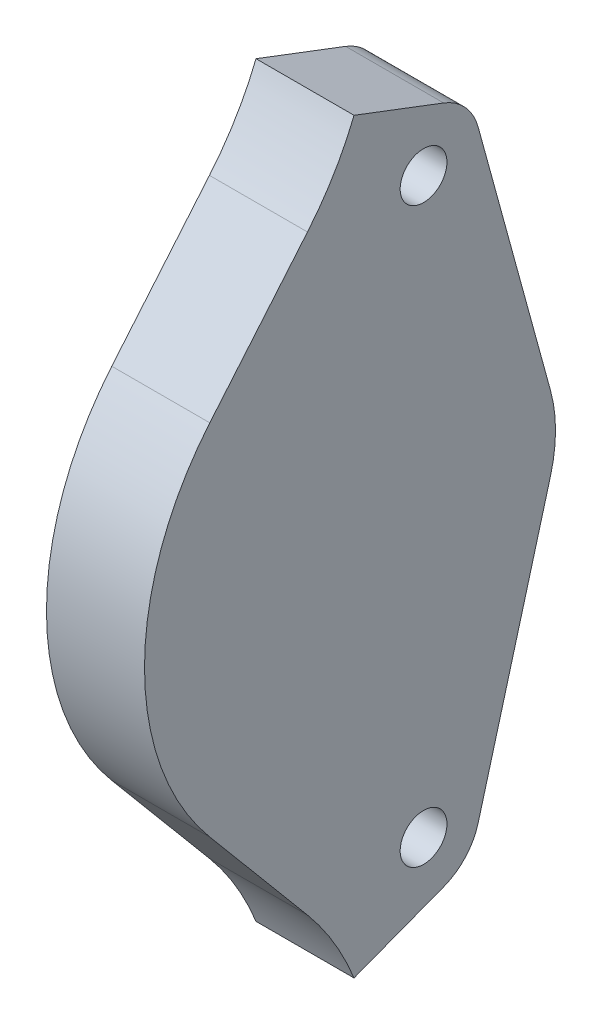
ISO-10303-21;
HEADER;
FILE_DESCRIPTION(('STEP AP214'),'2;1');
FILE_NAME('part.step','',(''),(''),'','','');
FILE_SCHEMA(('AUTOMOTIVE_DESIGN { 1 0 10303 214 1 1 1 1 }'));
ENDSEC;
DATA;
#1=APPLICATION_CONTEXT('core data for automotive mechanical design processes');
#2=APPLICATION_PROTOCOL_DEFINITION('international standard','automotive_design',2000,#1);
#3=PRODUCT_CONTEXT('',#1,'mechanical');
#4=PRODUCT('Part','Part','',(#3));
#5=PRODUCT_RELATED_PRODUCT_CATEGORY('part','',(#4));
#6=PRODUCT_DEFINITION_FORMATION('','',#4);
#7=PRODUCT_DEFINITION_CONTEXT('part definition',#1,'design');
#8=PRODUCT_DEFINITION('design','',#6,#7);
#9=PRODUCT_DEFINITION_SHAPE('','',#8);
#10=(LENGTH_UNIT() NAMED_UNIT(*) SI_UNIT(.MILLI.,.METRE.));
#11=(NAMED_UNIT(*) PLANE_ANGLE_UNIT() SI_UNIT($,.RADIAN.));
#12=(NAMED_UNIT(*) SI_UNIT($,.STERADIAN.) SOLID_ANGLE_UNIT());
#13=UNCERTAINTY_MEASURE_WITH_UNIT(LENGTH_MEASURE(1.E-05),#10,'distance_accuracy_value','');
#14=(GEOMETRIC_REPRESENTATION_CONTEXT(3) GLOBAL_UNCERTAINTY_ASSIGNED_CONTEXT((#13)) GLOBAL_UNIT_ASSIGNED_CONTEXT((#10,
#11,#12)) REPRESENTATION_CONTEXT('',''));
#15=CARTESIAN_POINT('',(0.,0.,0.));
#16=DIRECTION('',(0.,0.,1.));
#17=DIRECTION('',(1.,0.,0.));
#18=AXIS2_PLACEMENT_3D('',#15,#16,#17);
#19=CARTESIAN_POINT('',(95.7499999999999,147.,97.1));
#20=DIRECTION('',(1.,0.,0.));
#21=DIRECTION('',(0.,0.,-1.));
#22=AXIS2_PLACEMENT_3D('',#19,#20,#21);
#23=CYLINDRICAL_SURFACE('',#22,5.25);
#24=CARTESIAN_POINT('',(99.4999999999999,147.,97.1));
#25=DIRECTION('',(1.,0.,0.));
#26=DIRECTION('',(0.,0.,-1.));
#27=AXIS2_PLACEMENT_3D('',#24,#25,#26);
#28=CIRCLE('',#27,5.25);
#29=CARTESIAN_POINT('',(99.4999999999999,147.,91.85));
#30=VERTEX_POINT('',#29);
#31=EDGE_CURVE('E194',#30,#30,#28,.T.);
#32=ORIENTED_EDGE('',*,*,#31,.T.);
#33=EDGE_LOOP('',(#32));
#34=FACE_BOUND('',#33,.T.);
#35=CARTESIAN_POINT('',(91.9999999999999,147.,97.1));
#36=DIRECTION('',(1.,0.,0.));
#37=DIRECTION('',(0.,0.,-1.));
#38=AXIS2_PLACEMENT_3D('',#35,#36,#37);
#39=CIRCLE('',#38,5.25);
#40=CARTESIAN_POINT('',(91.9999999999999,147.,91.85));
#41=VERTEX_POINT('',#40);
#42=EDGE_CURVE('E19',#41,#41,#39,.F.);
#43=ORIENTED_EDGE('',*,*,#42,.T.);
#44=EDGE_LOOP('',(#43));
#45=FACE_BOUND('',#44,.T.);
#46=ADVANCED_FACE('F16',(#34,#45),#23,.F.);
#47=CARTESIAN_POINT('',(95.7499999999999,71.,97.1));
#48=DIRECTION('',(1.,0.,0.));
#49=DIRECTION('',(0.,0.,-1.));
#50=AXIS2_PLACEMENT_3D('',#47,#48,#49);
#51=CYLINDRICAL_SURFACE('',#50,5.25);
#52=CARTESIAN_POINT('',(99.4999999999999,71.,97.1));
#53=DIRECTION('',(1.,0.,0.));
#54=DIRECTION('',(0.,0.,-1.));
#55=AXIS2_PLACEMENT_3D('',#52,#53,#54);
#56=CIRCLE('',#55,5.25);
#57=CARTESIAN_POINT('',(99.4999999999999,71.,91.85));
#58=VERTEX_POINT('',#57);
#59=EDGE_CURVE('E121',#58,#58,#56,.T.);
#60=ORIENTED_EDGE('',*,*,#59,.T.);
#61=EDGE_LOOP('',(#60));
#62=FACE_BOUND('',#61,.T.);
#63=CARTESIAN_POINT('',(91.9999999999999,71.,97.1));
#64=DIRECTION('',(1.,0.,0.));
#65=DIRECTION('',(0.,0.,-1.));
#66=AXIS2_PLACEMENT_3D('',#63,#64,#65);
#67=CIRCLE('',#66,5.25);
#68=CARTESIAN_POINT('',(91.9999999999999,71.,91.85));
#69=VERTEX_POINT('',#68);
#70=EDGE_CURVE('E196',#69,#69,#67,.F.);
#71=ORIENTED_EDGE('',*,*,#70,.T.);
#72=EDGE_LOOP('',(#71));
#73=FACE_BOUND('',#72,.T.);
#74=ADVANCED_FACE('F206',(#62,#73),#51,.F.);
#75=CARTESIAN_POINT('',(91.9999999999999,109.,90.6));
#76=DIRECTION('',(1.,0.,0.));
#77=DIRECTION('',(0.,0.,-1.));
#78=AXIS2_PLACEMENT_3D('',#75,#76,#77);
#79=PLANE('',#78);
#80=ORIENTED_EDGE('',*,*,#70,.F.);
#81=EDGE_LOOP('',(#80));
#82=FACE_BOUND('',#81,.T.);
#83=ORIENTED_EDGE('',*,*,#42,.F.);
#84=EDGE_LOOP('',(#83));
#85=FACE_BOUND('',#84,.T.);
#86=CARTESIAN_POINT('',(91.9999999999999,147.,97.1));
#87=DIRECTION('',(1.,0.,0.));
#88=DIRECTION('',(0.,0.,-1.));
#89=AXIS2_PLACEMENT_3D('',#86,#87,#88);
#90=CIRCLE('',#89,7.50000000000002);
#91=CARTESIAN_POINT('',(91.9999999999999,148.980247065203,89.8661475297907));
#92=VERTEX_POINT('',#91);
#93=CARTESIAN_POINT('',(91.9999999999999,154.009182211021,94.4314114718247));
#94=VERTEX_POINT('',#93);
#95=EDGE_CURVE('E179',#92,#94,#90,.T.);
#96=ORIENTED_EDGE('',*,*,#95,.F.);
#97=DIRECTION('',(0.,-0.964513662694572,-0.264032942027129));
#98=VECTOR('',#97,1.);
#99=CARTESIAN_POINT('',(91.9999999999999,148.980247065203,89.8661475297907));
#100=LINE('',#99,#98);
#101=CARTESIAN_POINT('',(91.9999999999999,113.867983528986,80.2542626998762));
#102=VERTEX_POINT('',#101);
#103=EDGE_CURVE('E133',#92,#102,#100,.T.);
#104=ORIENTED_EDGE('',*,*,#103,.T.);
#105=CARTESIAN_POINT('',(91.9999999999999,109.,98.0370309689852));
#106=DIRECTION('',(1.,0.,0.));
#107=DIRECTION('',(0.,0.,-1.));
#108=AXIS2_PLACEMENT_3D('',#105,#106,#107);
#109=CIRCLE('',#108,18.4370309689851);
#110=CARTESIAN_POINT('',(91.9999999999999,104.132016471014,80.2542626998762));
#111=VERTEX_POINT('',#110);
#112=EDGE_CURVE('E136',#111,#102,#109,.T.);
#113=ORIENTED_EDGE('',*,*,#112,.F.);
#114=DIRECTION('',(0.,-0.964513662694572,0.26403294202713));
#115=VECTOR('',#114,1.);
#116=CARTESIAN_POINT('',(91.9999999999999,104.132016471014,80.2542626998762));
#117=LINE('',#116,#115);
#118=CARTESIAN_POINT('',(91.9999999999999,69.0197529347966,89.8661475297909));
#119=VERTEX_POINT('',#118);
#120=EDGE_CURVE('E137',#111,#119,#117,.T.);
#121=ORIENTED_EDGE('',*,*,#120,.T.);
#122=CARTESIAN_POINT('',(91.9999999999999,71.,97.1));
#123=DIRECTION('',(1.,0.,0.));
#124=DIRECTION('',(0.,0.,-1.));
#125=AXIS2_PLACEMENT_3D('',#122,#123,#124);
#126=CIRCLE('',#125,7.49999999999999);
#127=CARTESIAN_POINT('',(91.9999999999999,63.9908177889881,94.4314114718232));
#128=VERTEX_POINT('',#127);
#129=EDGE_CURVE('E140',#128,#119,#126,.T.);
#130=ORIENTED_EDGE('',*,*,#129,.F.);
#131=DIRECTION('',(0.,-0.355811803757849,0.934557628135679));
#132=VECTOR('',#131,1.);
#133=CARTESIAN_POINT('',(91.9999999999999,63.9908177889937,94.4314114718303));
#134=LINE('',#133,#132);
#135=CARTESIAN_POINT('',(91.9999999999999,59.4654796082554,106.317440187114));
#136=VERTEX_POINT('',#135);
#137=EDGE_CURVE('E141',#128,#136,#134,.T.);
#138=ORIENTED_EDGE('',*,*,#137,.T.);
#139=CARTESIAN_POINT('',(91.9999999999999,45.3537478559113,141.6));
#140=DIRECTION('',(1.,0.,0.));
#141=DIRECTION('',(0.,0.,-1.));
#142=AXIS2_PLACEMENT_3D('',#139,#140,#141);
#143=CIRCLE('',#142,38.);
#144=CARTESIAN_POINT('',(91.9999999999999,69.7796770239999,112.490311161479));
#145=VERTEX_POINT('',#144);
#146=EDGE_CURVE('E187',#136,#145,#143,.T.);
#147=ORIENTED_EDGE('',*,*,#146,.T.);
#148=DIRECTION('',(0.,0.766044443118977,0.64278760968654));
#149=VECTOR('',#148,1.);
#150=CARTESIAN_POINT('',(91.9999999999999,85.216858441598,125.443644395402));
#151=LINE('',#150,#149);
#152=CARTESIAN_POINT('',(91.9999999999999,85.216858441598,125.443644395402));
#153=VERTEX_POINT('',#152);
#154=EDGE_CURVE('E145',#145,#153,#151,.T.);
#155=ORIENTED_EDGE('',*,*,#154,.T.);
#156=CARTESIAN_POINT('',(91.9999999999999,109.,97.1));
#157=DIRECTION('',(1.,0.,0.));
#158=DIRECTION('',(0.,0.,-1.));
#159=AXIS2_PLACEMENT_3D('',#156,#157,#158);
#160=CIRCLE('',#159,37.0000000000001);
#161=CARTESIAN_POINT('',(91.9999999999999,132.783141558402,125.443644395402));
#162=VERTEX_POINT('',#161);
#163=EDGE_CURVE('E147',#162,#153,#160,.T.);
#164=ORIENTED_EDGE('',*,*,#163,.F.);
#165=DIRECTION('',(0.,0.766044443118977,-0.64278760968654));
#166=VECTOR('',#165,1.);
#167=CARTESIAN_POINT('',(91.9999999999999,158.815383241973,103.6));
#168=LINE('',#167,#166);
#169=CARTESIAN_POINT('',(91.9999999999999,148.220322976,112.490311161479));
#170=VERTEX_POINT('',#169);
#171=EDGE_CURVE('E102',#162,#170,#168,.T.);
#172=ORIENTED_EDGE('',*,*,#171,.T.);
#173=CARTESIAN_POINT('',(91.9999999999999,172.646252144089,141.6));
#174=DIRECTION('',(1.,0.,0.));
#175=DIRECTION('',(0.,0.,-1.));
#176=AXIS2_PLACEMENT_3D('',#173,#174,#175);
#177=CIRCLE('',#176,38.);
#178=CARTESIAN_POINT('',(91.9999999999999,158.534520391745,106.317440187114));
#179=VERTEX_POINT('',#178);
#180=EDGE_CURVE('E104',#170,#179,#177,.T.);
#181=ORIENTED_EDGE('',*,*,#180,.T.);
#182=DIRECTION('',(0.,-0.355811803756703,-0.934557628136115));
#183=VECTOR('',#182,1.);
#184=CARTESIAN_POINT('',(91.9999999999999,158.534520391745,106.317440187114));
#185=LINE('',#184,#183);
#186=EDGE_CURVE('E108',#179,#94,#185,.T.);
#187=ORIENTED_EDGE('',*,*,#186,.T.);
#188=EDGE_LOOP('',(#96,#104,#113,#121,#130,#138,#147,#155,#164,#172,#181,#187));
#189=FACE_BOUND('',#188,.T.);
#190=ADVANCED_FACE('F107',(#82,#85,#189),#79,.F.);
#191=CARTESIAN_POINT('',(99.4999999999999,147.,97.1));
#192=DIRECTION('',(1.,0.,0.));
#193=DIRECTION('',(0.,0.,-1.));
#194=AXIS2_PLACEMENT_3D('',#191,#192,#193);
#195=PLANE('',#194);
#196=CARTESIAN_POINT('',(99.4999999999999,147.,97.1));
#197=DIRECTION('',(1.,0.,0.));
#198=DIRECTION('',(0.,0.,-1.));
#199=AXIS2_PLACEMENT_3D('',#196,#197,#198);
#200=CIRCLE('',#199,3.1);
#201=CARTESIAN_POINT('',(99.4999999999999,147.,94.));
#202=VERTEX_POINT('',#201);
#203=EDGE_CURVE('E176',#202,#202,#200,.T.);
#204=ORIENTED_EDGE('',*,*,#203,.T.);
#205=EDGE_LOOP('',(#204));
#206=FACE_BOUND('',#205,.T.);
#207=ORIENTED_EDGE('',*,*,#31,.F.);
#208=EDGE_LOOP('',(#207));
#209=FACE_BOUND('',#208,.T.);
#210=ADVANCED_FACE('F205',(#206,#209),#195,.F.);
#211=CARTESIAN_POINT('',(99.4999999999999,71.,97.1));
#212=DIRECTION('',(1.,0.,0.));
#213=DIRECTION('',(0.,0.,-1.));
#214=AXIS2_PLACEMENT_3D('',#211,#212,#213);
#215=PLANE('',#214);
#216=CARTESIAN_POINT('',(99.4999999999999,71.,97.1));
#217=DIRECTION('',(1.,0.,0.));
#218=DIRECTION('',(0.,0.,-1.));
#219=AXIS2_PLACEMENT_3D('',#216,#217,#218);
#220=CIRCLE('',#219,3.1);
#221=CARTESIAN_POINT('',(99.4999999999999,71.,94.));
#222=VERTEX_POINT('',#221);
#223=EDGE_CURVE('E173',#222,#222,#220,.T.);
#224=ORIENTED_EDGE('',*,*,#223,.T.);
#225=EDGE_LOOP('',(#224));
#226=FACE_BOUND('',#225,.T.);
#227=ORIENTED_EDGE('',*,*,#59,.F.);
#228=EDGE_LOOP('',(#227));
#229=FACE_BOUND('',#228,.T.);
#230=ADVANCED_FACE('F214',(#226,#229),#215,.F.);
#231=CARTESIAN_POINT('',(91.9999999999999,158.534520391745,106.317440187114));
#232=DIRECTION('',(0.,-0.934557628136115,0.355811803756703));
#233=DIRECTION('',(0.,-0.355811803756703,-0.934557628136115));
#234=AXIS2_PLACEMENT_3D('',#231,#232,#233);
#235=PLANE('',#234);
#236=DIRECTION('',(1.,0.,0.));
#237=VECTOR('',#236,1.);
#238=CARTESIAN_POINT('',(91.9999999999999,154.009182211021,94.4314114718248));
#239=LINE('',#238,#237);
#240=CARTESIAN_POINT('',(105.,154.009182211021,94.4314114718247));
#241=VERTEX_POINT('',#240);
#242=EDGE_CURVE('E119',#94,#241,#239,.T.);
#243=ORIENTED_EDGE('',*,*,#242,.F.);
#244=ORIENTED_EDGE('',*,*,#186,.F.);
#245=DIRECTION('',(1.,0.,0.));
#246=VECTOR('',#245,1.);
#247=CARTESIAN_POINT('',(105.,158.534520391745,106.317440187114));
#248=LINE('',#247,#246);
#249=CARTESIAN_POINT('',(105.,158.534520391745,106.317440187114));
#250=VERTEX_POINT('',#249);
#251=EDGE_CURVE('E113',#179,#250,#248,.T.);
#252=ORIENTED_EDGE('',*,*,#251,.T.);
#253=DIRECTION('',(0.,0.355811803756714,0.934557628136111));
#254=VECTOR('',#253,1.);
#255=CARTESIAN_POINT('',(105.,154.009182211021,94.4314114718247));
#256=LINE('',#255,#254);
#257=EDGE_CURVE('E172',#241,#250,#256,.T.);
#258=ORIENTED_EDGE('',*,*,#257,.F.);
#259=EDGE_LOOP('',(#243,#244,#252,#258));
#260=FACE_BOUND('',#259,.T.);
#261=ADVANCED_FACE('F116',(#260),#235,.F.);
#262=CARTESIAN_POINT('',(105.,172.646252144089,141.6));
#263=DIRECTION('',(1.,0.,0.));
#264=DIRECTION('',(0.,0.,-1.));
#265=AXIS2_PLACEMENT_3D('',#262,#263,#264);
#266=CYLINDRICAL_SURFACE('',#265,38.);
#267=ORIENTED_EDGE('',*,*,#180,.F.);
#268=DIRECTION('',(1.,0.,0.));
#269=VECTOR('',#268,1.);
#270=CARTESIAN_POINT('',(105.,148.220322976,112.490311161479));
#271=LINE('',#270,#269);
#272=CARTESIAN_POINT('',(105.,148.220322976,112.490311161479));
#273=VERTEX_POINT('',#272);
#274=EDGE_CURVE('E128',#170,#273,#271,.T.);
#275=ORIENTED_EDGE('',*,*,#274,.T.);
#276=CARTESIAN_POINT('',(105.,172.646252144089,141.6));
#277=DIRECTION('',(1.,0.,0.));
#278=DIRECTION('',(0.,0.,-1.));
#279=AXIS2_PLACEMENT_3D('',#276,#277,#278);
#280=CIRCLE('',#279,38.);
#281=EDGE_CURVE('E125',#250,#273,#280,.F.);
#282=ORIENTED_EDGE('',*,*,#281,.F.);
#283=ORIENTED_EDGE('',*,*,#251,.F.);
#284=EDGE_LOOP('',(#267,#275,#282,#283));
#285=FACE_BOUND('',#284,.T.);
#286=ADVANCED_FACE('F123',(#285),#266,.F.);
#287=CARTESIAN_POINT('',(105.,158.815383241973,103.6));
#288=DIRECTION('',(0.,-0.64278760968654,-0.766044443118977));
#289=DIRECTION('',(0.,0.766044443118977,-0.64278760968654));
#290=AXIS2_PLACEMENT_3D('',#287,#288,#289);
#291=PLANE('',#290);
#292=ORIENTED_EDGE('',*,*,#171,.F.);
#293=DIRECTION('',(1.,0.,0.));
#294=VECTOR('',#293,1.);
#295=CARTESIAN_POINT('',(105.,132.783141558402,125.443644395402));
#296=LINE('',#295,#294);
#297=CARTESIAN_POINT('',(105.,132.783141558402,125.443644395402));
#298=VERTEX_POINT('',#297);
#299=EDGE_CURVE('E190',#298,#162,#296,.F.);
#300=ORIENTED_EDGE('',*,*,#299,.F.);
#301=DIRECTION('',(0.,-0.766044443118984,0.642787609686532));
#302=VECTOR('',#301,1.);
#303=CARTESIAN_POINT('',(105.,148.220322976,112.490311161479));
#304=LINE('',#303,#302);
#305=EDGE_CURVE('E170',#273,#298,#304,.T.);
#306=ORIENTED_EDGE('',*,*,#305,.F.);
#307=ORIENTED_EDGE('',*,*,#274,.F.);
#308=EDGE_LOOP('',(#292,#300,#306,#307));
#309=FACE_BOUND('',#308,.T.);
#310=ADVANCED_FACE('F268',(#309),#291,.F.);
#311=CARTESIAN_POINT('',(105.,109.,97.1));
#312=DIRECTION('',(1.,0.,0.));
#313=DIRECTION('',(0.,0.,-1.));
#314=AXIS2_PLACEMENT_3D('',#311,#312,#313);
#315=CYLINDRICAL_SURFACE('',#314,37.0000000000001);
#316=ORIENTED_EDGE('',*,*,#163,.T.);
#317=DIRECTION('',(1.,0.,0.));
#318=VECTOR('',#317,1.);
#319=CARTESIAN_POINT('',(105.,85.216858441598,125.443644395402));
#320=LINE('',#319,#318);
#321=CARTESIAN_POINT('',(105.,85.2168584415983,125.443644395402));
#322=VERTEX_POINT('',#321);
#323=EDGE_CURVE('E146',#153,#322,#320,.T.);
#324=ORIENTED_EDGE('',*,*,#323,.T.);
#325=CARTESIAN_POINT('',(105.,109.,97.1));
#326=DIRECTION('',(1.,0.,0.));
#327=DIRECTION('',(0.,0.,-1.));
#328=AXIS2_PLACEMENT_3D('',#325,#326,#327);
#329=CIRCLE('',#328,37.0000000000001);
#330=EDGE_CURVE('E167',#298,#322,#329,.T.);
#331=ORIENTED_EDGE('',*,*,#330,.F.);
#332=ORIENTED_EDGE('',*,*,#299,.T.);
#333=EDGE_LOOP('',(#316,#324,#331,#332));
#334=FACE_BOUND('',#333,.T.);
#335=ADVANCED_FACE('F264',(#334),#315,.T.);
#336=CARTESIAN_POINT('',(105.,85.216858441598,125.443644395402));
#337=DIRECTION('',(0.,0.64278760968654,-0.766044443118977));
#338=DIRECTION('',(0.,0.766044443118977,0.64278760968654));
#339=AXIS2_PLACEMENT_3D('',#336,#337,#338);
#340=PLANE('',#339);
#341=DIRECTION('',(0.,-0.766044443118988,-0.642787609686527));
#342=VECTOR('',#341,1.);
#343=CARTESIAN_POINT('',(105.,85.216858441598,125.443644395402));
#344=LINE('',#343,#342);
#345=CARTESIAN_POINT('',(105.,69.7796770239996,112.490311161479));
#346=VERTEX_POINT('',#345);
#347=EDGE_CURVE('E166',#322,#346,#344,.T.);
#348=ORIENTED_EDGE('',*,*,#347,.F.);
#349=ORIENTED_EDGE('',*,*,#323,.F.);
#350=ORIENTED_EDGE('',*,*,#154,.F.);
#351=DIRECTION('',(1.,0.,0.));
#352=VECTOR('',#351,1.);
#353=CARTESIAN_POINT('',(105.,69.7796770239999,112.490311161479));
#354=LINE('',#353,#352);
#355=EDGE_CURVE('E144',#145,#346,#354,.T.);
#356=ORIENTED_EDGE('',*,*,#355,.T.);
#357=EDGE_LOOP('',(#348,#349,#350,#356));
#358=FACE_BOUND('',#357,.T.);
#359=ADVANCED_FACE('F260',(#358),#340,.F.);
#360=CARTESIAN_POINT('',(105.,45.3537478559113,141.6));
#361=DIRECTION('',(1.,0.,0.));
#362=DIRECTION('',(0.,0.,-1.));
#363=AXIS2_PLACEMENT_3D('',#360,#361,#362);
#364=CYLINDRICAL_SURFACE('',#363,38.);
#365=CARTESIAN_POINT('',(105.,45.3537478559113,141.6));
#366=DIRECTION('',(1.,0.,0.));
#367=DIRECTION('',(0.,0.,-1.));
#368=AXIS2_PLACEMENT_3D('',#365,#366,#367);
#369=CIRCLE('',#368,38.);
#370=CARTESIAN_POINT('',(105.,59.4654796082554,106.317440187114));
#371=VERTEX_POINT('',#370);
#372=EDGE_CURVE('E163',#346,#371,#369,.F.);
#373=ORIENTED_EDGE('',*,*,#372,.F.);
#374=ORIENTED_EDGE('',*,*,#355,.F.);
#375=ORIENTED_EDGE('',*,*,#146,.F.);
#376=DIRECTION('',(1.,0.,0.));
#377=VECTOR('',#376,1.);
#378=CARTESIAN_POINT('',(91.9999999999999,59.4654796082553,106.317440187114));
#379=LINE('',#378,#377);
#380=EDGE_CURVE('E143',#136,#371,#379,.T.);
#381=ORIENTED_EDGE('',*,*,#380,.T.);
#382=EDGE_LOOP('',(#373,#374,#375,#381));
#383=FACE_BOUND('',#382,.T.);
#384=ADVANCED_FACE('F256',(#383),#364,.F.);
#385=CARTESIAN_POINT('',(91.9999999999999,63.9908177889937,94.4314114718303));
#386=DIRECTION('',(0.,0.934557628135679,0.355811803757849));
#387=DIRECTION('',(0.,-0.355811803757849,0.934557628135679));
#388=AXIS2_PLACEMENT_3D('',#385,#386,#387);
#389=PLANE('',#388);
#390=ORIENTED_EDGE('',*,*,#380,.F.);
#391=ORIENTED_EDGE('',*,*,#137,.F.);
#392=DIRECTION('',(1.,0.,0.));
#393=VECTOR('',#392,1.);
#394=CARTESIAN_POINT('',(91.9999999999999,63.9908177889792,94.4314114718247));
#395=LINE('',#394,#393);
#396=CARTESIAN_POINT('',(105.,63.9908177889792,94.4314114718247));
#397=VERTEX_POINT('',#396);
#398=EDGE_CURVE('E186',#397,#128,#395,.F.);
#399=ORIENTED_EDGE('',*,*,#398,.F.);
#400=DIRECTION('',(0.,0.355811803756703,-0.934557628136115));
#401=VECTOR('',#400,1.);
#402=CARTESIAN_POINT('',(105.,59.4654796082554,106.317440187114));
#403=LINE('',#402,#401);
#404=EDGE_CURVE('E162',#371,#397,#403,.T.);
#405=ORIENTED_EDGE('',*,*,#404,.F.);
#406=EDGE_LOOP('',(#390,#391,#399,#405));
#407=FACE_BOUND('',#406,.T.);
#408=ADVANCED_FACE('F252',(#407),#389,.F.);
#409=CARTESIAN_POINT('',(91.9999999999999,71.,97.1));
#410=DIRECTION('',(1.,0.,0.));
#411=DIRECTION('',(0.,0.,-1.));
#412=AXIS2_PLACEMENT_3D('',#409,#410,#411);
#413=CYLINDRICAL_SURFACE('',#412,7.49999999999999);
#414=ORIENTED_EDGE('',*,*,#129,.T.);
#415=DIRECTION('',(1.,0.,0.));
#416=VECTOR('',#415,1.);
#417=CARTESIAN_POINT('',(91.9999999999999,69.0197529347966,89.8661475297909));
#418=LINE('',#417,#416);
#419=CARTESIAN_POINT('',(105.,69.0197529347966,89.8661475297908));
#420=VERTEX_POINT('',#419);
#421=EDGE_CURVE('E139',#119,#420,#418,.T.);
#422=ORIENTED_EDGE('',*,*,#421,.T.);
#423=CARTESIAN_POINT('',(105.,71.,97.1));
#424=DIRECTION('',(1.,0.,0.));
#425=DIRECTION('',(0.,0.,-1.));
#426=AXIS2_PLACEMENT_3D('',#423,#424,#425);
#427=CIRCLE('',#426,7.49999999999999);
#428=EDGE_CURVE('E159',#397,#420,#427,.T.);
#429=ORIENTED_EDGE('',*,*,#428,.F.);
#430=ORIENTED_EDGE('',*,*,#398,.T.);
#431=EDGE_LOOP('',(#414,#422,#429,#430));
#432=FACE_BOUND('',#431,.T.);
#433=ADVANCED_FACE('F248',(#432),#413,.T.);
#434=CARTESIAN_POINT('',(91.9999999999999,104.132016471014,80.2542626998762));
#435=DIRECTION('',(0.,0.26403294202713,0.964513662694572));
#436=DIRECTION('',(0.,-0.964513662694572,0.26403294202713));
#437=AXIS2_PLACEMENT_3D('',#434,#435,#436);
#438=PLANE('',#437);
#439=ORIENTED_EDGE('',*,*,#421,.F.);
#440=ORIENTED_EDGE('',*,*,#120,.F.);
#441=DIRECTION('',(1.,0.,0.));
#442=VECTOR('',#441,1.);
#443=CARTESIAN_POINT('',(91.9999999999999,104.132016471014,80.254262699876));
#444=LINE('',#443,#442);
#445=CARTESIAN_POINT('',(105.,104.132016471014,80.2542626998762));
#446=VERTEX_POINT('',#445);
#447=EDGE_CURVE('E183',#446,#111,#444,.F.);
#448=ORIENTED_EDGE('',*,*,#447,.F.);
#449=DIRECTION('',(0.,0.964513662694573,-0.264032942027125));
#450=VECTOR('',#449,1.);
#451=CARTESIAN_POINT('',(105.,69.0197529347966,89.8661475297907));
#452=LINE('',#451,#450);
#453=EDGE_CURVE('E158',#420,#446,#452,.T.);
#454=ORIENTED_EDGE('',*,*,#453,.F.);
#455=EDGE_LOOP('',(#439,#440,#448,#454));
#456=FACE_BOUND('',#455,.T.);
#457=ADVANCED_FACE('F244',(#456),#438,.F.);
#458=CARTESIAN_POINT('',(91.9999999999999,109.,98.0370309689852));
#459=DIRECTION('',(1.,0.,0.));
#460=DIRECTION('',(0.,0.,-1.));
#461=AXIS2_PLACEMENT_3D('',#458,#459,#460);
#462=CYLINDRICAL_SURFACE('',#461,18.4370309689851);
#463=ORIENTED_EDGE('',*,*,#112,.T.);
#464=DIRECTION('',(1.,0.,0.));
#465=VECTOR('',#464,1.);
#466=CARTESIAN_POINT('',(91.9999999999999,113.867983528986,80.2542626998762));
#467=LINE('',#466,#465);
#468=CARTESIAN_POINT('',(105.,113.867983528986,80.2542626998762));
#469=VERTEX_POINT('',#468);
#470=EDGE_CURVE('E135',#102,#469,#467,.T.);
#471=ORIENTED_EDGE('',*,*,#470,.T.);
#472=CARTESIAN_POINT('',(105.,109.,98.0370309689852));
#473=DIRECTION('',(1.,0.,0.));
#474=DIRECTION('',(0.,0.,-1.));
#475=AXIS2_PLACEMENT_3D('',#472,#473,#474);
#476=CIRCLE('',#475,18.4370309689851);
#477=EDGE_CURVE('E155',#446,#469,#476,.T.);
#478=ORIENTED_EDGE('',*,*,#477,.F.);
#479=ORIENTED_EDGE('',*,*,#447,.T.);
#480=EDGE_LOOP('',(#463,#471,#478,#479));
#481=FACE_BOUND('',#480,.T.);
#482=ADVANCED_FACE('F241',(#481),#462,.T.);
#483=CARTESIAN_POINT('',(91.9999999999999,148.980247065203,89.8661475297907));
#484=DIRECTION('',(0.,-0.264032942027129,0.964513662694572));
#485=DIRECTION('',(0.,-0.964513662694572,-0.264032942027129));
#486=AXIS2_PLACEMENT_3D('',#483,#484,#485);
#487=PLANE('',#486);
#488=ORIENTED_EDGE('',*,*,#470,.F.);
#489=ORIENTED_EDGE('',*,*,#103,.F.);
#490=DIRECTION('',(1.,0.,0.));
#491=VECTOR('',#490,1.);
#492=CARTESIAN_POINT('',(91.9999999999999,148.980247065203,89.8661475297906));
#493=LINE('',#492,#491);
#494=CARTESIAN_POINT('',(105.,148.980247065203,89.8661475297907));
#495=VERTEX_POINT('',#494);
#496=EDGE_CURVE('E34',#495,#92,#493,.F.);
#497=ORIENTED_EDGE('',*,*,#496,.F.);
#498=DIRECTION('',(0.,0.964513662694572,0.264032942027128));
#499=VECTOR('',#498,1.);
#500=CARTESIAN_POINT('',(105.,113.867983528986,80.2542626998762));
#501=LINE('',#500,#499);
#502=EDGE_CURVE('E154',#469,#495,#501,.T.);
#503=ORIENTED_EDGE('',*,*,#502,.F.);
#504=EDGE_LOOP('',(#488,#489,#497,#503));
#505=FACE_BOUND('',#504,.T.);
#506=ADVANCED_FACE('F237',(#505),#487,.F.);
#507=CARTESIAN_POINT('',(91.9999999999999,147.,97.1));
#508=DIRECTION('',(1.,0.,0.));
#509=DIRECTION('',(0.,0.,-1.));
#510=AXIS2_PLACEMENT_3D('',#507,#508,#509);
#511=CYLINDRICAL_SURFACE('',#510,7.50000000000002);
#512=ORIENTED_EDGE('',*,*,#95,.T.);
#513=ORIENTED_EDGE('',*,*,#242,.T.);
#514=CARTESIAN_POINT('',(105.,147.,97.1));
#515=DIRECTION('',(1.,0.,0.));
#516=DIRECTION('',(0.,0.,-1.));
#517=AXIS2_PLACEMENT_3D('',#514,#515,#516);
#518=CIRCLE('',#517,7.50000000000002);
#519=EDGE_CURVE('E151',#495,#241,#518,.T.);
#520=ORIENTED_EDGE('',*,*,#519,.F.);
#521=ORIENTED_EDGE('',*,*,#496,.T.);
#522=EDGE_LOOP('',(#512,#513,#520,#521));
#523=FACE_BOUND('',#522,.T.);
#524=ADVANCED_FACE('F233',(#523),#511,.T.);
#525=CARTESIAN_POINT('',(104.1,147.,97.1));
#526=DIRECTION('',(1.,0.,0.));
#527=DIRECTION('',(0.,0.,-1.));
#528=AXIS2_PLACEMENT_3D('',#525,#526,#527);
#529=CYLINDRICAL_SURFACE('',#528,3.1);
#530=CARTESIAN_POINT('',(105.,147.,97.1));
#531=DIRECTION('',(1.,0.,0.));
#532=DIRECTION('',(0.,0.,-1.));
#533=AXIS2_PLACEMENT_3D('',#530,#531,#532);
#534=CIRCLE('',#533,3.1);
#535=CARTESIAN_POINT('',(105.,147.,94.));
#536=VERTEX_POINT('',#535);
#537=EDGE_CURVE('E25',#536,#536,#534,.F.);
#538=ORIENTED_EDGE('',*,*,#537,.F.);
#539=EDGE_LOOP('',(#538));
#540=FACE_BOUND('',#539,.T.);
#541=ORIENTED_EDGE('',*,*,#203,.F.);
#542=EDGE_LOOP('',(#541));
#543=FACE_BOUND('',#542,.T.);
#544=ADVANCED_FACE('F226',(#540,#543),#529,.F.);
#545=CARTESIAN_POINT('',(104.1,71.,97.1));
#546=DIRECTION('',(1.,0.,0.));
#547=DIRECTION('',(0.,0.,-1.));
#548=AXIS2_PLACEMENT_3D('',#545,#546,#547);
#549=CYLINDRICAL_SURFACE('',#548,3.1);
#550=CARTESIAN_POINT('',(105.,71.,97.1));
#551=DIRECTION('',(1.,0.,0.));
#552=DIRECTION('',(0.,0.,-1.));
#553=AXIS2_PLACEMENT_3D('',#550,#551,#552);
#554=CIRCLE('',#553,3.1);
#555=CARTESIAN_POINT('',(105.,71.,94.));
#556=VERTEX_POINT('',#555);
#557=EDGE_CURVE('E11',#556,#556,#554,.F.);
#558=ORIENTED_EDGE('',*,*,#557,.F.);
#559=EDGE_LOOP('',(#558));
#560=FACE_BOUND('',#559,.T.);
#561=ORIENTED_EDGE('',*,*,#223,.F.);
#562=EDGE_LOOP('',(#561));
#563=FACE_BOUND('',#562,.T.);
#564=ADVANCED_FACE('F220',(#560,#563),#549,.F.);
#565=CARTESIAN_POINT('',(105.,109.,90.6));
#566=DIRECTION('',(1.,0.,0.));
#567=DIRECTION('',(0.,0.,-1.));
#568=AXIS2_PLACEMENT_3D('',#565,#566,#567);
#569=PLANE('',#568);
#570=ORIENTED_EDGE('',*,*,#557,.T.);
#571=EDGE_LOOP('',(#570));
#572=FACE_BOUND('',#571,.T.);
#573=ORIENTED_EDGE('',*,*,#537,.T.);
#574=EDGE_LOOP('',(#573));
#575=FACE_BOUND('',#574,.T.);
#576=ORIENTED_EDGE('',*,*,#502,.T.);
#577=ORIENTED_EDGE('',*,*,#519,.T.);
#578=ORIENTED_EDGE('',*,*,#257,.T.);
#579=ORIENTED_EDGE('',*,*,#281,.T.);
#580=ORIENTED_EDGE('',*,*,#305,.T.);
#581=ORIENTED_EDGE('',*,*,#330,.T.);
#582=ORIENTED_EDGE('',*,*,#347,.T.);
#583=ORIENTED_EDGE('',*,*,#372,.T.);
#584=ORIENTED_EDGE('',*,*,#404,.T.);
#585=ORIENTED_EDGE('',*,*,#428,.T.);
#586=ORIENTED_EDGE('',*,*,#453,.T.);
#587=ORIENTED_EDGE('',*,*,#477,.T.);
#588=EDGE_LOOP('',(#576,#577,#578,#579,#580,#581,#582,#583,#584,#585,#586,#587));
#589=FACE_BOUND('',#588,.T.);
#590=ADVANCED_FACE('F218',(#572,#575,#589),#569,.T.);
#591=CLOSED_SHELL('',(#46,#74,#190,#210,#230,#261,#286,#310,#335,#359,#384,#408,#433,#457,#482,
#506,#524,#544,#564,#590));
#592=MANIFOLD_SOLID_BREP('B1',#591);
#593=ADVANCED_BREP_SHAPE_REPRESENTATION('',(#18,#592),#14);
#594=SHAPE_DEFINITION_REPRESENTATION(#9,#593);
ENDSEC;
END-ISO-10303-21;
